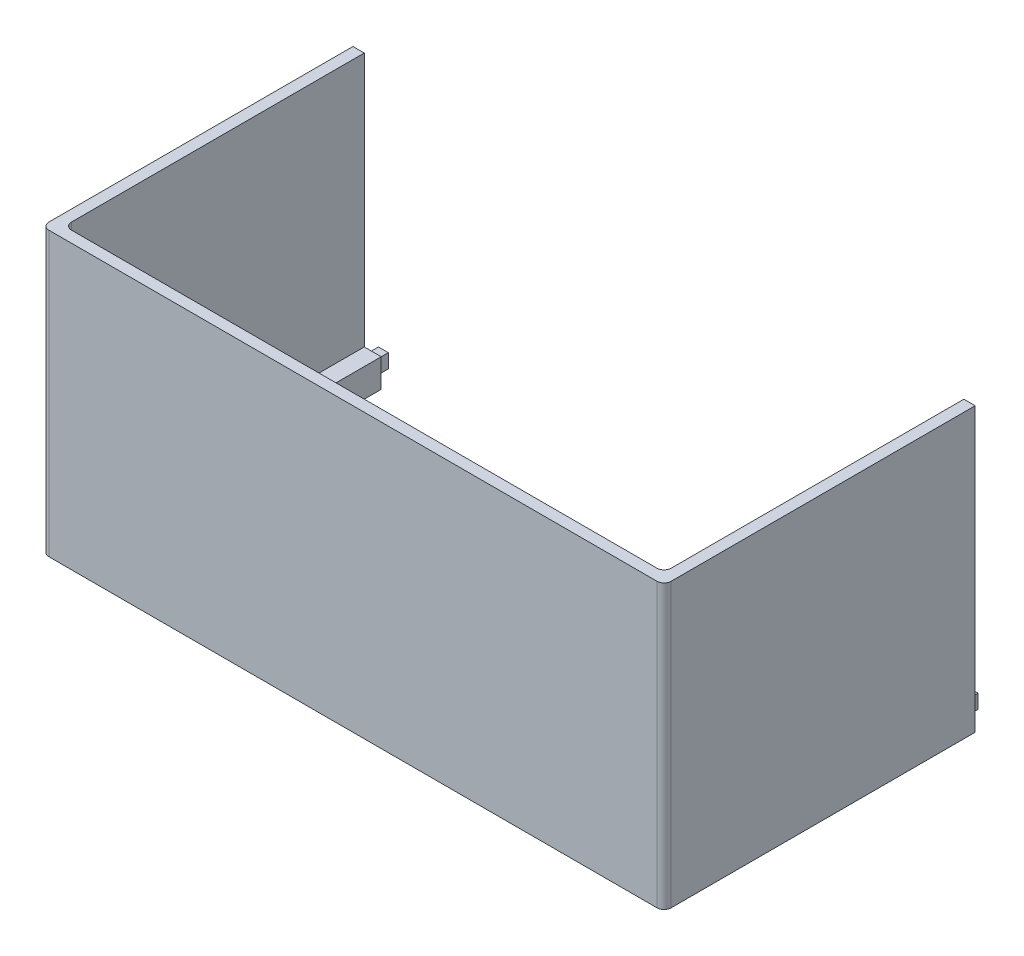
ISO-10303-21;
HEADER;
FILE_DESCRIPTION(('STEP AP214'),'2;1');
FILE_NAME('part.step','',(''),(''),'','','');
FILE_SCHEMA(('AUTOMOTIVE_DESIGN { 1 0 10303 214 1 1 1 1 }'));
ENDSEC;
DATA;
#1=APPLICATION_CONTEXT('core data for automotive mechanical design processes');
#2=APPLICATION_PROTOCOL_DEFINITION('international standard','automotive_design',2000,#1);
#3=PRODUCT_CONTEXT('',#1,'mechanical');
#4=PRODUCT('Part','Part','',(#3));
#5=PRODUCT_RELATED_PRODUCT_CATEGORY('part','',(#4));
#6=PRODUCT_DEFINITION_FORMATION('','',#4);
#7=PRODUCT_DEFINITION_CONTEXT('part definition',#1,'design');
#8=PRODUCT_DEFINITION('design','',#6,#7);
#9=PRODUCT_DEFINITION_SHAPE('','',#8);
#10=(LENGTH_UNIT() NAMED_UNIT(*) SI_UNIT(.MILLI.,.METRE.));
#11=(NAMED_UNIT(*) PLANE_ANGLE_UNIT() SI_UNIT($,.RADIAN.));
#12=(NAMED_UNIT(*) SI_UNIT($,.STERADIAN.) SOLID_ANGLE_UNIT());
#13=UNCERTAINTY_MEASURE_WITH_UNIT(LENGTH_MEASURE(1.E-05),#10,'distance_accuracy_value','');
#14=(GEOMETRIC_REPRESENTATION_CONTEXT(3) GLOBAL_UNCERTAINTY_ASSIGNED_CONTEXT((#13)) GLOBAL_UNIT_ASSIGNED_CONTEXT((#10,
#11,#12)) REPRESENTATION_CONTEXT('',''));
#15=CARTESIAN_POINT('',(0.,0.,0.));
#16=DIRECTION('',(0.,0.,1.));
#17=DIRECTION('',(1.,0.,0.));
#18=AXIS2_PLACEMENT_3D('',#15,#16,#17);
#19=CARTESIAN_POINT('',(-69.85,0.,7.25423999999999));
#20=DIRECTION('',(0.,0.,1.));
#21=DIRECTION('',(1.,0.,0.));
#22=AXIS2_PLACEMENT_3D('',#19,#20,#21);
#23=PLANE('',#22);
#24=DIRECTION('',(1.,0.,0.));
#25=VECTOR('',#24,1.);
#26=CARTESIAN_POINT('',(-69.85,0.,7.25423999999999));
#27=LINE('',#26,#25);
#28=CARTESIAN_POINT('',(-69.85,0.,7.25423999999999));
#29=VERTEX_POINT('',#28);
#30=CARTESIAN_POINT('',(-63.5000000000001,0.,7.25423999999999));
#31=VERTEX_POINT('',#30);
#32=EDGE_CURVE('E260',#29,#31,#27,.T.);
#33=ORIENTED_EDGE('',*,*,#32,.F.);
#34=DIRECTION('',(0.,1.,0.));
#35=VECTOR('',#34,1.);
#36=CARTESIAN_POINT('',(-69.85,0.,7.25423999999999));
#37=LINE('',#36,#35);
#38=CARTESIAN_POINT('',(-69.85,63.5,7.25423999999999));
#39=VERTEX_POINT('',#38);
#40=EDGE_CURVE('E263',#29,#39,#37,.T.);
#41=ORIENTED_EDGE('',*,*,#40,.T.);
#42=DIRECTION('',(1.,0.,0.));
#43=VECTOR('',#42,1.);
#44=CARTESIAN_POINT('',(-69.85,63.5,7.25423999999999));
#45=LINE('',#44,#43);
#46=CARTESIAN_POINT('',(-67.31,63.5,7.25423999999999));
#47=VERTEX_POINT('',#46);
#48=EDGE_CURVE('E265',#39,#47,#45,.T.);
#49=ORIENTED_EDGE('',*,*,#48,.T.);
#50=DIRECTION('',(0.,-1.,0.));
#51=VECTOR('',#50,1.);
#52=CARTESIAN_POINT('',(-67.31,63.5,7.25423999999999));
#53=LINE('',#52,#51);
#54=CARTESIAN_POINT('',(-67.31,6.35,7.25423999999999));
#55=VERTEX_POINT('',#54);
#56=EDGE_CURVE('E335',#47,#55,#53,.T.);
#57=ORIENTED_EDGE('',*,*,#56,.T.);
#58=DIRECTION('',(-1.,0.,0.));
#59=VECTOR('',#58,1.);
#60=CARTESIAN_POINT('',(0.,6.35,7.25423999999999));
#61=LINE('',#60,#59);
#62=CARTESIAN_POINT('',(-63.5000000000001,6.35,7.25423999999999));
#63=VERTEX_POINT('',#62);
#64=EDGE_CURVE('E270',#63,#55,#61,.T.);
#65=ORIENTED_EDGE('',*,*,#64,.F.);
#66=DIRECTION('',(0.,1.,0.));
#67=VECTOR('',#66,1.);
#68=CARTESIAN_POINT('',(-63.5000000000001,0.,7.25423999999999));
#69=LINE('',#68,#67);
#70=EDGE_CURVE('E274',#31,#63,#69,.T.);
#71=ORIENTED_EDGE('',*,*,#70,.F.);
#72=EDGE_LOOP('',(#33,#41,#49,#57,#65,#71));
#73=FACE_BOUND('',#72,.T.);
#74=DIRECTION('',(1.,0.,0.));
#75=VECTOR('',#74,1.);
#76=CARTESIAN_POINT('',(-67.31,4.7625,7.25423999999999));
#77=LINE('',#76,#75);
#78=CARTESIAN_POINT('',(-67.31,4.7625,7.25423999999999));
#79=VERTEX_POINT('',#78);
#80=CARTESIAN_POINT('',(-65.0875,4.7625,7.25423999999999));
#81=VERTEX_POINT('',#80);
#82=EDGE_CURVE('E220',#79,#81,#77,.T.);
#83=ORIENTED_EDGE('',*,*,#82,.F.);
#84=DIRECTION('',(0.,1.,0.));
#85=VECTOR('',#84,1.);
#86=CARTESIAN_POINT('',(-67.31,4.7625,7.25423999999999));
#87=LINE('',#86,#85);
#88=CARTESIAN_POINT('',(-67.31,1.5875,7.25423999999999));
#89=VERTEX_POINT('',#88);
#90=EDGE_CURVE('E217',#89,#79,#87,.T.);
#91=ORIENTED_EDGE('',*,*,#90,.F.);
#92=DIRECTION('',(-1.,0.,0.));
#93=VECTOR('',#92,1.);
#94=CARTESIAN_POINT('',(-67.31,1.5875,7.25423999999999));
#95=LINE('',#94,#93);
#96=CARTESIAN_POINT('',(-65.0875,1.5875,7.25423999999999));
#97=VERTEX_POINT('',#96);
#98=EDGE_CURVE('E690',#97,#89,#95,.T.);
#99=ORIENTED_EDGE('',*,*,#98,.F.);
#100=DIRECTION('',(0.,-1.,0.));
#101=VECTOR('',#100,1.);
#102=CARTESIAN_POINT('',(-65.0875,4.7625,7.25423999999999));
#103=LINE('',#102,#101);
#104=EDGE_CURVE('E692',#81,#97,#103,.T.);
#105=ORIENTED_EDGE('',*,*,#104,.F.);
#106=EDGE_LOOP('',(#83,#91,#99,#105));
#107=FACE_BOUND('',#106,.T.);
#108=ADVANCED_FACE('F34',(#73,#107),#23,.F.);
#109=CARTESIAN_POINT('',(67.31,6.35,7.25423999999999));
#110=VERTEX_POINT('',#109);
#111=CARTESIAN_POINT('',(63.5,6.35,7.25423999999999));
#112=VERTEX_POINT('',#111);
#113=EDGE_CURVE('E275',#110,#112,#61,.T.);
#114=ORIENTED_EDGE('',*,*,#113,.F.);
#115=DIRECTION('',(0.,1.,0.));
#116=VECTOR('',#115,1.);
#117=CARTESIAN_POINT('',(67.31,63.5,7.25423999999999));
#118=LINE('',#117,#116);
#119=CARTESIAN_POINT('',(67.31,63.5,7.25423999999999));
#120=VERTEX_POINT('',#119);
#121=EDGE_CURVE('E278',#110,#120,#118,.T.);
#122=ORIENTED_EDGE('',*,*,#121,.T.);
#123=CARTESIAN_POINT('',(69.85,63.5,7.25423999999999));
#124=VERTEX_POINT('',#123);
#125=EDGE_CURVE('E259',#120,#124,#45,.T.);
#126=ORIENTED_EDGE('',*,*,#125,.T.);
#127=DIRECTION('',(0.,1.,0.));
#128=VECTOR('',#127,1.);
#129=CARTESIAN_POINT('',(69.85,0.,7.25423999999999));
#130=LINE('',#129,#128);
#131=CARTESIAN_POINT('',(69.85,0.,7.25423999999999));
#132=VERTEX_POINT('',#131);
#133=EDGE_CURVE('E267',#132,#124,#130,.T.);
#134=ORIENTED_EDGE('',*,*,#133,.F.);
#135=CARTESIAN_POINT('',(63.5,0.,7.25423999999999));
#136=VERTEX_POINT('',#135);
#137=EDGE_CURVE('E264',#136,#132,#27,.T.);
#138=ORIENTED_EDGE('',*,*,#137,.F.);
#139=DIRECTION('',(0.,-1.,0.));
#140=VECTOR('',#139,1.);
#141=CARTESIAN_POINT('',(63.5,0.,7.25423999999999));
#142=LINE('',#141,#140);
#143=EDGE_CURVE('E281',#112,#136,#142,.T.);
#144=ORIENTED_EDGE('',*,*,#143,.F.);
#145=EDGE_LOOP('',(#114,#122,#126,#134,#138,#144));
#146=FACE_BOUND('',#145,.T.);
#147=DIRECTION('',(0.,-1.,0.));
#148=VECTOR('',#147,1.);
#149=CARTESIAN_POINT('',(67.31,4.7625,7.25423999999999));
#150=LINE('',#149,#148);
#151=CARTESIAN_POINT('',(67.31,4.7625,7.25423999999999));
#152=VERTEX_POINT('',#151);
#153=CARTESIAN_POINT('',(67.31,1.5875,7.25423999999999));
#154=VERTEX_POINT('',#153);
#155=EDGE_CURVE('E221',#152,#154,#150,.T.);
#156=ORIENTED_EDGE('',*,*,#155,.F.);
#157=DIRECTION('',(1.,0.,0.));
#158=VECTOR('',#157,1.);
#159=CARTESIAN_POINT('',(67.31,4.7625,7.25423999999999));
#160=LINE('',#159,#158);
#161=CARTESIAN_POINT('',(65.0875,4.7625,7.25423999999999));
#162=VERTEX_POINT('',#161);
#163=EDGE_CURVE('E234',#162,#152,#160,.T.);
#164=ORIENTED_EDGE('',*,*,#163,.F.);
#165=DIRECTION('',(0.,1.,0.));
#166=VECTOR('',#165,1.);
#167=CARTESIAN_POINT('',(65.0875,4.7625,7.25423999999999));
#168=LINE('',#167,#166);
#169=CARTESIAN_POINT('',(65.0875,1.5875,7.25423999999999));
#170=VERTEX_POINT('',#169);
#171=EDGE_CURVE('E243',#170,#162,#168,.T.);
#172=ORIENTED_EDGE('',*,*,#171,.F.);
#173=DIRECTION('',(-1.,0.,0.));
#174=VECTOR('',#173,1.);
#175=CARTESIAN_POINT('',(67.31,1.5875,7.25423999999999));
#176=LINE('',#175,#174);
#177=EDGE_CURVE('E224',#154,#170,#176,.T.);
#178=ORIENTED_EDGE('',*,*,#177,.F.);
#179=EDGE_LOOP('',(#156,#164,#172,#178));
#180=FACE_BOUND('',#179,.T.);
#181=ADVANCED_FACE('F394',(#146,#180),#23,.F.);
#182=CARTESIAN_POINT('',(69.85,6.35,77.10424));
#183=DIRECTION('',(-1.,0.,0.));
#184=DIRECTION('',(0.,0.,1.));
#185=AXIS2_PLACEMENT_3D('',#182,#183,#184);
#186=PLANE('',#185);
#187=DIRECTION('',(0.,0.,-1.));
#188=VECTOR('',#187,1.);
#189=CARTESIAN_POINT('',(69.85,63.5,-77.10424));
#190=LINE('',#189,#188);
#191=CARTESIAN_POINT('',(69.85,63.5,75.51674));
#192=VERTEX_POINT('',#191);
#193=EDGE_CURVE('E294',#192,#124,#190,.T.);
#194=ORIENTED_EDGE('',*,*,#193,.F.);
#195=DIRECTION('',(0.,-1.,0.));
#196=VECTOR('',#195,1.);
#197=CARTESIAN_POINT('',(69.85,6.35,75.51674));
#198=LINE('',#197,#196);
#199=CARTESIAN_POINT('',(69.85,0.,75.51674));
#200=VERTEX_POINT('',#199);
#201=EDGE_CURVE('E363',#192,#200,#198,.T.);
#202=ORIENTED_EDGE('',*,*,#201,.T.);
#203=DIRECTION('',(0.,0.,-1.));
#204=VECTOR('',#203,1.);
#205=CARTESIAN_POINT('',(69.85,0.,77.10424));
#206=LINE('',#205,#204);
#207=EDGE_CURVE('E325',#200,#132,#206,.T.);
#208=ORIENTED_EDGE('',*,*,#207,.T.);
#209=ORIENTED_EDGE('',*,*,#133,.T.);
#210=EDGE_LOOP('',(#194,#202,#208,#209));
#211=FACE_BOUND('',#210,.T.);
#212=ADVANCED_FACE('F434',(#211),#186,.F.);
#213=CARTESIAN_POINT('',(-69.85,6.35,77.10424));
#214=DIRECTION('',(1.,0.,0.));
#215=DIRECTION('',(0.,0.,-1.));
#216=AXIS2_PLACEMENT_3D('',#213,#214,#215);
#217=PLANE('',#216);
#218=DIRECTION('',(0.,0.,1.));
#219=VECTOR('',#218,1.);
#220=CARTESIAN_POINT('',(-69.85,0.,77.10424));
#221=LINE('',#220,#219);
#222=CARTESIAN_POINT('',(-69.85,0.,75.51674));
#223=VERTEX_POINT('',#222);
#224=EDGE_CURVE('E329',#29,#223,#221,.T.);
#225=ORIENTED_EDGE('',*,*,#224,.T.);
#226=DIRECTION('',(0.,-1.,0.));
#227=VECTOR('',#226,1.);
#228=CARTESIAN_POINT('',(-69.85,6.35,75.51674));
#229=LINE('',#228,#227);
#230=CARTESIAN_POINT('',(-69.85,63.5,75.51674));
#231=VERTEX_POINT('',#230);
#232=EDGE_CURVE('E346',#223,#231,#229,.F.);
#233=ORIENTED_EDGE('',*,*,#232,.T.);
#234=DIRECTION('',(0.,0.,1.));
#235=VECTOR('',#234,1.);
#236=CARTESIAN_POINT('',(-69.85,63.5,-77.10424));
#237=LINE('',#236,#235);
#238=EDGE_CURVE('E300',#39,#231,#237,.T.);
#239=ORIENTED_EDGE('',*,*,#238,.F.);
#240=ORIENTED_EDGE('',*,*,#40,.F.);
#241=EDGE_LOOP('',(#225,#233,#239,#240));
#242=FACE_BOUND('',#241,.T.);
#243=ADVANCED_FACE('F419',(#242),#217,.F.);
#244=CARTESIAN_POINT('',(-69.85,6.35,77.10424));
#245=DIRECTION('',(0.,0.,-1.));
#246=DIRECTION('',(-1.,0.,0.));
#247=AXIS2_PLACEMENT_3D('',#244,#245,#246);
#248=PLANE('',#247);
#249=DIRECTION('',(1.,0.,0.));
#250=VECTOR('',#249,1.);
#251=CARTESIAN_POINT('',(-69.85,63.5,77.10424));
#252=LINE('',#251,#250);
#253=CARTESIAN_POINT('',(-68.2624999999999,63.5,77.10424));
#254=VERTEX_POINT('',#253);
#255=CARTESIAN_POINT('',(68.2625,63.5,77.10424));
#256=VERTEX_POINT('',#255);
#257=EDGE_CURVE('E303',#254,#256,#252,.T.);
#258=ORIENTED_EDGE('',*,*,#257,.F.);
#259=DIRECTION('',(0.,-1.,0.));
#260=VECTOR('',#259,1.);
#261=CARTESIAN_POINT('',(-68.2624999999999,6.35,77.10424));
#262=LINE('',#261,#260);
#263=CARTESIAN_POINT('',(-68.2624999999999,0.,77.10424));
#264=VERTEX_POINT('',#263);
#265=EDGE_CURVE('E339',#254,#264,#262,.T.);
#266=ORIENTED_EDGE('',*,*,#265,.T.);
#267=DIRECTION('',(1.,0.,0.));
#268=VECTOR('',#267,1.);
#269=CARTESIAN_POINT('',(-69.85,0.,77.10424));
#270=LINE('',#269,#268);
#271=CARTESIAN_POINT('',(68.2625,0.,77.10424));
#272=VERTEX_POINT('',#271);
#273=EDGE_CURVE('E332',#264,#272,#270,.T.);
#274=ORIENTED_EDGE('',*,*,#273,.T.);
#275=DIRECTION('',(0.,-1.,0.));
#276=VECTOR('',#275,1.);
#277=CARTESIAN_POINT('',(68.2625,6.35,77.10424));
#278=LINE('',#277,#276);
#279=EDGE_CURVE('E337',#272,#256,#278,.F.);
#280=ORIENTED_EDGE('',*,*,#279,.T.);
#281=EDGE_LOOP('',(#258,#266,#274,#280));
#282=FACE_BOUND('',#281,.T.);
#283=ADVANCED_FACE('F428',(#282),#248,.F.);
#284=CARTESIAN_POINT('',(0.,6.35,0.));
#285=DIRECTION('',(0.,-1.,0.));
#286=DIRECTION('',(0.,0.,-1.));
#287=AXIS2_PLACEMENT_3D('',#284,#285,#286);
#288=PLANE('',#287);
#289=DIRECTION('',(0.,0.,1.));
#290=VECTOR('',#289,1.);
#291=CARTESIAN_POINT('',(-67.31,6.35,-74.56424));
#292=LINE('',#291,#290);
#293=CARTESIAN_POINT('',(-67.31,6.35,72.97674));
#294=VERTEX_POINT('',#293);
#295=EDGE_CURVE('E296',#55,#294,#292,.T.);
#296=ORIENTED_EDGE('',*,*,#295,.T.);
#297=CARTESIAN_POINT('',(-65.7225,6.35,72.97674));
#298=DIRECTION('',(0.,-1.,0.));
#299=DIRECTION('',(0.,0.,-1.));
#300=AXIS2_PLACEMENT_3D('',#297,#298,#299);
#301=CIRCLE('',#300,1.5875);
#302=CARTESIAN_POINT('',(-65.7225,6.35,74.56424));
#303=VERTEX_POINT('',#302);
#304=EDGE_CURVE('E57',#294,#303,#301,.F.);
#305=ORIENTED_EDGE('',*,*,#304,.T.);
#306=DIRECTION('',(1.,0.,0.));
#307=VECTOR('',#306,1.);
#308=CARTESIAN_POINT('',(-67.31,6.35,74.56424));
#309=LINE('',#308,#307);
#310=CARTESIAN_POINT('',(65.7225,6.35,74.56424));
#311=VERTEX_POINT('',#310);
#312=EDGE_CURVE('E288',#303,#311,#309,.T.);
#313=ORIENTED_EDGE('',*,*,#312,.T.);
#314=CARTESIAN_POINT('',(65.7225,6.35,72.97674));
#315=DIRECTION('',(0.,-1.,0.));
#316=DIRECTION('',(0.,0.,-1.));
#317=AXIS2_PLACEMENT_3D('',#314,#315,#316);
#318=CIRCLE('',#317,1.5875);
#319=CARTESIAN_POINT('',(67.31,6.35,72.97674));
#320=VERTEX_POINT('',#319);
#321=EDGE_CURVE('E49',#311,#320,#318,.F.);
#322=ORIENTED_EDGE('',*,*,#321,.T.);
#323=DIRECTION('',(0.,0.,-1.));
#324=VECTOR('',#323,1.);
#325=CARTESIAN_POINT('',(67.31,6.35,-74.56424));
#326=LINE('',#325,#324);
#327=EDGE_CURVE('E284',#320,#110,#326,.T.);
#328=ORIENTED_EDGE('',*,*,#327,.T.);
#329=ORIENTED_EDGE('',*,*,#113,.T.);
#330=DIRECTION('',(0.,0.,-1.));
#331=VECTOR('',#330,1.);
#332=CARTESIAN_POINT('',(63.5,6.35,70.75424));
#333=LINE('',#332,#331);
#334=CARTESIAN_POINT('',(63.5,6.35,70.75424));
#335=VERTEX_POINT('',#334);
#336=EDGE_CURVE('E306',#335,#112,#333,.T.);
#337=ORIENTED_EDGE('',*,*,#336,.F.);
#338=DIRECTION('',(1.,0.,0.));
#339=VECTOR('',#338,1.);
#340=CARTESIAN_POINT('',(-63.5000000000001,6.35,70.75424));
#341=LINE('',#340,#339);
#342=CARTESIAN_POINT('',(-63.5000000000001,6.35,70.75424));
#343=VERTEX_POINT('',#342);
#344=EDGE_CURVE('E311',#343,#335,#341,.T.);
#345=ORIENTED_EDGE('',*,*,#344,.F.);
#346=DIRECTION('',(0.,0.,1.));
#347=VECTOR('',#346,1.);
#348=CARTESIAN_POINT('',(-63.5000000000001,6.35,70.75424));
#349=LINE('',#348,#347);
#350=EDGE_CURVE('E319',#63,#343,#349,.T.);
#351=ORIENTED_EDGE('',*,*,#350,.F.);
#352=ORIENTED_EDGE('',*,*,#64,.T.);
#353=EDGE_LOOP('',(#296,#305,#313,#322,#328,#329,#337,#345,#351,#352));
#354=FACE_BOUND('',#353,.T.);
#355=ADVANCED_FACE('F381',(#354),#288,.F.);
#356=CARTESIAN_POINT('',(0.,0.,0.));
#357=DIRECTION('',(0.,-1.,0.));
#358=DIRECTION('',(0.,0.,-1.));
#359=AXIS2_PLACEMENT_3D('',#356,#357,#358);
#360=PLANE('',#359);
#361=ORIENTED_EDGE('',*,*,#273,.F.);
#362=CARTESIAN_POINT('',(-68.2624999999999,0.,75.51674));
#363=DIRECTION('',(0.,-1.,0.));
#364=DIRECTION('',(0.,0.,-1.));
#365=AXIS2_PLACEMENT_3D('',#362,#363,#364);
#366=CIRCLE('',#365,1.5875);
#367=EDGE_CURVE('E344',#264,#223,#366,.T.);
#368=ORIENTED_EDGE('',*,*,#367,.T.);
#369=ORIENTED_EDGE('',*,*,#224,.F.);
#370=ORIENTED_EDGE('',*,*,#32,.T.);
#371=DIRECTION('',(0.,0.,1.));
#372=VECTOR('',#371,1.);
#373=CARTESIAN_POINT('',(-63.5000000000001,0.,70.75424));
#374=LINE('',#373,#372);
#375=CARTESIAN_POINT('',(-63.5000000000001,0.,70.75424));
#376=VERTEX_POINT('',#375);
#377=EDGE_CURVE('E310',#31,#376,#374,.T.);
#378=ORIENTED_EDGE('',*,*,#377,.T.);
#379=DIRECTION('',(1.,0.,0.));
#380=VECTOR('',#379,1.);
#381=CARTESIAN_POINT('',(-63.5000000000001,0.,70.75424));
#382=LINE('',#381,#380);
#383=CARTESIAN_POINT('',(63.5,0.,70.75424));
#384=VERTEX_POINT('',#383);
#385=EDGE_CURVE('E313',#376,#384,#382,.T.);
#386=ORIENTED_EDGE('',*,*,#385,.T.);
#387=DIRECTION('',(0.,0.,-1.));
#388=VECTOR('',#387,1.);
#389=CARTESIAN_POINT('',(63.5,0.,70.75424));
#390=LINE('',#389,#388);
#391=EDGE_CURVE('E307',#384,#136,#390,.T.);
#392=ORIENTED_EDGE('',*,*,#391,.T.);
#393=ORIENTED_EDGE('',*,*,#137,.T.);
#394=ORIENTED_EDGE('',*,*,#207,.F.);
#395=CARTESIAN_POINT('',(68.2625,0.,75.51674));
#396=DIRECTION('',(0.,-1.,0.));
#397=DIRECTION('',(0.,0.,-1.));
#398=AXIS2_PLACEMENT_3D('',#395,#396,#397);
#399=CIRCLE('',#398,1.5875);
#400=EDGE_CURVE('E342',#200,#272,#399,.T.);
#401=ORIENTED_EDGE('',*,*,#400,.T.);
#402=EDGE_LOOP('',(#361,#368,#369,#370,#378,#386,#392,#393,#394,#401));
#403=FACE_BOUND('',#402,.T.);
#404=ADVANCED_FACE('F416',(#403),#360,.T.);
#405=CARTESIAN_POINT('',(63.5,0.,70.75424));
#406=DIRECTION('',(1.,0.,0.));
#407=DIRECTION('',(0.,0.,-1.));
#408=AXIS2_PLACEMENT_3D('',#405,#406,#407);
#409=PLANE('',#408);
#410=ORIENTED_EDGE('',*,*,#336,.T.);
#411=ORIENTED_EDGE('',*,*,#143,.T.);
#412=ORIENTED_EDGE('',*,*,#391,.F.);
#413=DIRECTION('',(0.,1.,0.));
#414=VECTOR('',#413,1.);
#415=CARTESIAN_POINT('',(63.5,0.,70.75424));
#416=LINE('',#415,#414);
#417=EDGE_CURVE('E323',#384,#335,#416,.T.);
#418=ORIENTED_EDGE('',*,*,#417,.T.);
#419=EDGE_LOOP('',(#410,#411,#412,#418));
#420=FACE_BOUND('',#419,.T.);
#421=ADVANCED_FACE('F400',(#420),#409,.F.);
#422=CARTESIAN_POINT('',(-63.5000000000001,0.,70.75424));
#423=DIRECTION('',(0.,0.,1.));
#424=DIRECTION('',(1.,0.,0.));
#425=AXIS2_PLACEMENT_3D('',#422,#423,#424);
#426=PLANE('',#425);
#427=ORIENTED_EDGE('',*,*,#344,.T.);
#428=ORIENTED_EDGE('',*,*,#417,.F.);
#429=ORIENTED_EDGE('',*,*,#385,.F.);
#430=DIRECTION('',(0.,1.,0.));
#431=VECTOR('',#430,1.);
#432=CARTESIAN_POINT('',(-63.5000000000001,0.,70.75424));
#433=LINE('',#432,#431);
#434=EDGE_CURVE('E316',#376,#343,#433,.T.);
#435=ORIENTED_EDGE('',*,*,#434,.T.);
#436=EDGE_LOOP('',(#427,#428,#429,#435));
#437=FACE_BOUND('',#436,.T.);
#438=ADVANCED_FACE('F404',(#437),#426,.F.);
#439=CARTESIAN_POINT('',(-63.5000000000001,0.,70.75424));
#440=DIRECTION('',(-1.,0.,0.));
#441=DIRECTION('',(0.,0.,1.));
#442=AXIS2_PLACEMENT_3D('',#439,#440,#441);
#443=PLANE('',#442);
#444=ORIENTED_EDGE('',*,*,#377,.F.);
#445=ORIENTED_EDGE('',*,*,#70,.T.);
#446=ORIENTED_EDGE('',*,*,#350,.T.);
#447=ORIENTED_EDGE('',*,*,#434,.F.);
#448=EDGE_LOOP('',(#444,#445,#446,#447));
#449=FACE_BOUND('',#448,.T.);
#450=ADVANCED_FACE('F409',(#449),#443,.F.);
#451=CARTESIAN_POINT('',(0.,63.5,0.));
#452=DIRECTION('',(0.,1.,0.));
#453=DIRECTION('',(0.,0.,1.));
#454=AXIS2_PLACEMENT_3D('',#451,#452,#453);
#455=PLANE('',#454);
#456=ORIENTED_EDGE('',*,*,#238,.T.);
#457=CARTESIAN_POINT('',(-68.2624999999999,63.5,75.51674));
#458=DIRECTION('',(0.,1.,0.));
#459=DIRECTION('',(0.,0.,1.));
#460=AXIS2_PLACEMENT_3D('',#457,#458,#459);
#461=CIRCLE('',#460,1.5875);
#462=EDGE_CURVE('E350',#231,#254,#461,.T.);
#463=ORIENTED_EDGE('',*,*,#462,.T.);
#464=ORIENTED_EDGE('',*,*,#257,.T.);
#465=CARTESIAN_POINT('',(68.2625,63.5,75.51674));
#466=DIRECTION('',(0.,1.,0.));
#467=DIRECTION('',(0.,0.,1.));
#468=AXIS2_PLACEMENT_3D('',#465,#466,#467);
#469=CIRCLE('',#468,1.5875);
#470=EDGE_CURVE('E348',#256,#192,#469,.T.);
#471=ORIENTED_EDGE('',*,*,#470,.T.);
#472=ORIENTED_EDGE('',*,*,#193,.T.);
#473=ORIENTED_EDGE('',*,*,#125,.F.);
#474=DIRECTION('',(0.,0.,-1.));
#475=VECTOR('',#474,1.);
#476=CARTESIAN_POINT('',(67.31,63.5,-74.56424));
#477=LINE('',#476,#475);
#478=CARTESIAN_POINT('',(67.31,63.5,72.97674));
#479=VERTEX_POINT('',#478);
#480=EDGE_CURVE('E285',#479,#120,#477,.T.);
#481=ORIENTED_EDGE('',*,*,#480,.F.);
#482=CARTESIAN_POINT('',(65.7225,63.5,72.97674));
#483=DIRECTION('',(0.,1.,0.));
#484=DIRECTION('',(0.,0.,1.));
#485=AXIS2_PLACEMENT_3D('',#482,#483,#484);
#486=CIRCLE('',#485,1.5875);
#487=CARTESIAN_POINT('',(65.7225,63.5,74.56424));
#488=VERTEX_POINT('',#487);
#489=EDGE_CURVE('E11',#479,#488,#486,.F.);
#490=ORIENTED_EDGE('',*,*,#489,.T.);
#491=DIRECTION('',(1.,0.,0.));
#492=VECTOR('',#491,1.);
#493=CARTESIAN_POINT('',(-67.31,63.5,74.56424));
#494=LINE('',#493,#492);
#495=CARTESIAN_POINT('',(-65.7225,63.5,74.56424));
#496=VERTEX_POINT('',#495);
#497=EDGE_CURVE('E291',#496,#488,#494,.T.);
#498=ORIENTED_EDGE('',*,*,#497,.F.);
#499=CARTESIAN_POINT('',(-65.7225,63.5,72.97674));
#500=DIRECTION('',(0.,1.,0.));
#501=DIRECTION('',(0.,0.,1.));
#502=AXIS2_PLACEMENT_3D('',#499,#500,#501);
#503=CIRCLE('',#502,1.5875);
#504=CARTESIAN_POINT('',(-67.31,63.5,72.97674));
#505=VERTEX_POINT('',#504);
#506=EDGE_CURVE('E42',#496,#505,#503,.F.);
#507=ORIENTED_EDGE('',*,*,#506,.T.);
#508=DIRECTION('',(0.,0.,1.));
#509=VECTOR('',#508,1.);
#510=CARTESIAN_POINT('',(-67.31,63.5,-74.56424));
#511=LINE('',#510,#509);
#512=EDGE_CURVE('E287',#47,#505,#511,.T.);
#513=ORIENTED_EDGE('',*,*,#512,.F.);
#514=ORIENTED_EDGE('',*,*,#48,.F.);
#515=EDGE_LOOP('',(#456,#463,#464,#471,#472,#473,#481,#490,#498,#507,#513,#514));
#516=FACE_BOUND('',#515,.T.);
#517=ADVANCED_FACE('F369',(#516),#455,.T.);
#518=CARTESIAN_POINT('',(67.31,63.5,-74.56424));
#519=DIRECTION('',(-1.,0.,0.));
#520=DIRECTION('',(0.,0.,1.));
#521=AXIS2_PLACEMENT_3D('',#518,#519,#520);
#522=PLANE('',#521);
#523=ORIENTED_EDGE('',*,*,#327,.F.);
#524=DIRECTION('',(0.,-1.,0.));
#525=VECTOR('',#524,1.);
#526=CARTESIAN_POINT('',(67.31,63.5,72.97674));
#527=LINE('',#526,#525);
#528=EDGE_CURVE('E361',#320,#479,#527,.F.);
#529=ORIENTED_EDGE('',*,*,#528,.T.);
#530=ORIENTED_EDGE('',*,*,#480,.T.);
#531=ORIENTED_EDGE('',*,*,#121,.F.);
#532=EDGE_LOOP('',(#523,#529,#530,#531));
#533=FACE_BOUND('',#532,.T.);
#534=ADVANCED_FACE('F387',(#533),#522,.T.);
#535=CARTESIAN_POINT('',(-67.31,63.5,-74.56424));
#536=DIRECTION('',(1.,0.,0.));
#537=DIRECTION('',(0.,0.,-1.));
#538=AXIS2_PLACEMENT_3D('',#535,#536,#537);
#539=PLANE('',#538);
#540=ORIENTED_EDGE('',*,*,#512,.T.);
#541=DIRECTION('',(0.,-1.,0.));
#542=VECTOR('',#541,1.);
#543=CARTESIAN_POINT('',(-67.31,6.35,72.97674));
#544=LINE('',#543,#542);
#545=EDGE_CURVE('E352',#505,#294,#544,.T.);
#546=ORIENTED_EDGE('',*,*,#545,.T.);
#547=ORIENTED_EDGE('',*,*,#295,.F.);
#548=ORIENTED_EDGE('',*,*,#56,.F.);
#549=EDGE_LOOP('',(#540,#546,#547,#548));
#550=FACE_BOUND('',#549,.T.);
#551=ADVANCED_FACE('F376',(#550),#539,.T.);
#552=CARTESIAN_POINT('',(-67.31,63.5,74.56424));
#553=DIRECTION('',(0.,0.,-1.));
#554=DIRECTION('',(-1.,0.,0.));
#555=AXIS2_PLACEMENT_3D('',#552,#553,#554);
#556=PLANE('',#555);
#557=ORIENTED_EDGE('',*,*,#312,.F.);
#558=DIRECTION('',(0.,-1.,0.));
#559=VECTOR('',#558,1.);
#560=CARTESIAN_POINT('',(-65.7225,63.5,74.56424));
#561=LINE('',#560,#559);
#562=EDGE_CURVE('E359',#303,#496,#561,.F.);
#563=ORIENTED_EDGE('',*,*,#562,.T.);
#564=ORIENTED_EDGE('',*,*,#497,.T.);
#565=DIRECTION('',(0.,-1.,0.));
#566=VECTOR('',#565,1.);
#567=CARTESIAN_POINT('',(65.7225,6.35,74.56424));
#568=LINE('',#567,#566);
#569=EDGE_CURVE('E357',#488,#311,#568,.T.);
#570=ORIENTED_EDGE('',*,*,#569,.T.);
#571=EDGE_LOOP('',(#557,#563,#564,#570));
#572=FACE_BOUND('',#571,.T.);
#573=ADVANCED_FACE('F380',(#572),#556,.T.);
#574=CARTESIAN_POINT('',(67.31,4.7625,4.07924));
#575=DIRECTION('',(-1.,0.,0.));
#576=DIRECTION('',(0.,0.,1.));
#577=AXIS2_PLACEMENT_3D('',#574,#575,#576);
#578=PLANE('',#577);
#579=ORIENTED_EDGE('',*,*,#155,.T.);
#580=DIRECTION('',(0.,0.,1.));
#581=VECTOR('',#580,1.);
#582=CARTESIAN_POINT('',(67.31,1.5875,4.07924));
#583=LINE('',#582,#581);
#584=CARTESIAN_POINT('',(67.31,1.5875,4.07924));
#585=VERTEX_POINT('',#584);
#586=EDGE_CURVE('E256',#585,#154,#583,.T.);
#587=ORIENTED_EDGE('',*,*,#586,.F.);
#588=DIRECTION('',(0.,-1.,0.));
#589=VECTOR('',#588,1.);
#590=CARTESIAN_POINT('',(67.31,4.7625,4.07924));
#591=LINE('',#590,#589);
#592=CARTESIAN_POINT('',(67.31,4.7625,4.07924));
#593=VERTEX_POINT('',#592);
#594=EDGE_CURVE('E230',#593,#585,#591,.T.);
#595=ORIENTED_EDGE('',*,*,#594,.F.);
#596=DIRECTION('',(0.,0.,1.));
#597=VECTOR('',#596,1.);
#598=CARTESIAN_POINT('',(67.31,4.7625,4.07924));
#599=LINE('',#598,#597);
#600=EDGE_CURVE('E239',#593,#152,#599,.T.);
#601=ORIENTED_EDGE('',*,*,#600,.T.);
#602=EDGE_LOOP('',(#579,#587,#595,#601));
#603=FACE_BOUND('',#602,.T.);
#604=ADVANCED_FACE('F452',(#603),#578,.F.);
#605=CARTESIAN_POINT('',(67.31,1.5875,4.07924));
#606=DIRECTION('',(0.,1.,0.));
#607=DIRECTION('',(0.,0.,1.));
#608=AXIS2_PLACEMENT_3D('',#605,#606,#607);
#609=PLANE('',#608);
#610=ORIENTED_EDGE('',*,*,#177,.T.);
#611=DIRECTION('',(0.,0.,1.));
#612=VECTOR('',#611,1.);
#613=CARTESIAN_POINT('',(65.0875,1.5875,4.07924));
#614=LINE('',#613,#612);
#615=CARTESIAN_POINT('',(65.0875,1.5875,4.07924));
#616=VERTEX_POINT('',#615);
#617=EDGE_CURVE('E253',#616,#170,#614,.T.);
#618=ORIENTED_EDGE('',*,*,#617,.F.);
#619=DIRECTION('',(-1.,0.,0.));
#620=VECTOR('',#619,1.);
#621=CARTESIAN_POINT('',(67.31,1.5875,4.07924));
#622=LINE('',#621,#620);
#623=EDGE_CURVE('E233',#585,#616,#622,.T.);
#624=ORIENTED_EDGE('',*,*,#623,.F.);
#625=ORIENTED_EDGE('',*,*,#586,.T.);
#626=EDGE_LOOP('',(#610,#618,#624,#625));
#627=FACE_BOUND('',#626,.T.);
#628=ADVANCED_FACE('F587',(#627),#609,.F.);
#629=CARTESIAN_POINT('',(65.0875,4.7625,4.07924));
#630=DIRECTION('',(1.,0.,0.));
#631=DIRECTION('',(0.,0.,-1.));
#632=AXIS2_PLACEMENT_3D('',#629,#630,#631);
#633=PLANE('',#632);
#634=ORIENTED_EDGE('',*,*,#171,.T.);
#635=DIRECTION('',(0.,0.,1.));
#636=VECTOR('',#635,1.);
#637=CARTESIAN_POINT('',(65.0875,4.7625,4.07924));
#638=LINE('',#637,#636);
#639=CARTESIAN_POINT('',(65.0875,4.7625,4.07924));
#640=VERTEX_POINT('',#639);
#641=EDGE_CURVE('E250',#640,#162,#638,.T.);
#642=ORIENTED_EDGE('',*,*,#641,.F.);
#643=DIRECTION('',(0.,1.,0.));
#644=VECTOR('',#643,1.);
#645=CARTESIAN_POINT('',(65.0875,4.7625,4.07924));
#646=LINE('',#645,#644);
#647=EDGE_CURVE('E236',#616,#640,#646,.T.);
#648=ORIENTED_EDGE('',*,*,#647,.F.);
#649=ORIENTED_EDGE('',*,*,#617,.T.);
#650=EDGE_LOOP('',(#634,#642,#648,#649));
#651=FACE_BOUND('',#650,.T.);
#652=ADVANCED_FACE('F579',(#651),#633,.F.);
#653=CARTESIAN_POINT('',(67.31,4.7625,4.07924));
#654=DIRECTION('',(0.,-1.,0.));
#655=DIRECTION('',(0.,0.,-1.));
#656=AXIS2_PLACEMENT_3D('',#653,#654,#655);
#657=PLANE('',#656);
#658=ORIENTED_EDGE('',*,*,#163,.T.);
#659=ORIENTED_EDGE('',*,*,#600,.F.);
#660=DIRECTION('',(1.,0.,0.));
#661=VECTOR('',#660,1.);
#662=CARTESIAN_POINT('',(67.31,4.7625,4.07924));
#663=LINE('',#662,#661);
#664=EDGE_CURVE('E238',#640,#593,#663,.T.);
#665=ORIENTED_EDGE('',*,*,#664,.F.);
#666=ORIENTED_EDGE('',*,*,#641,.T.);
#667=EDGE_LOOP('',(#658,#659,#665,#666));
#668=FACE_BOUND('',#667,.T.);
#669=ADVANCED_FACE('F571',(#668),#657,.F.);
#670=CARTESIAN_POINT('',(0.,0.,4.07924));
#671=DIRECTION('',(0.,0.,-1.));
#672=DIRECTION('',(-1.,0.,0.));
#673=AXIS2_PLACEMENT_3D('',#670,#671,#672);
#674=PLANE('',#673);
#675=ORIENTED_EDGE('',*,*,#594,.T.);
#676=ORIENTED_EDGE('',*,*,#623,.T.);
#677=ORIENTED_EDGE('',*,*,#647,.T.);
#678=ORIENTED_EDGE('',*,*,#664,.T.);
#679=EDGE_LOOP('',(#675,#676,#677,#678));
#680=FACE_BOUND('',#679,.T.);
#681=ADVANCED_FACE('F564',(#680),#674,.T.);
#682=CARTESIAN_POINT('',(-67.31,4.7625,4.07924));
#683=DIRECTION('',(0.,-1.,0.));
#684=DIRECTION('',(0.,0.,-1.));
#685=AXIS2_PLACEMENT_3D('',#682,#683,#684);
#686=PLANE('',#685);
#687=ORIENTED_EDGE('',*,*,#82,.T.);
#688=DIRECTION('',(0.,0.,1.));
#689=VECTOR('',#688,1.);
#690=CARTESIAN_POINT('',(-65.0875,4.7625,4.07924));
#691=LINE('',#690,#689);
#692=CARTESIAN_POINT('',(-65.0875,4.7625,4.07924));
#693=VERTEX_POINT('',#692);
#694=EDGE_CURVE('E201',#693,#81,#691,.T.);
#695=ORIENTED_EDGE('',*,*,#694,.F.);
#696=DIRECTION('',(1.,0.,0.));
#697=VECTOR('',#696,1.);
#698=CARTESIAN_POINT('',(-67.31,4.7625,4.07924));
#699=LINE('',#698,#697);
#700=CARTESIAN_POINT('',(-67.31,4.7625,4.07924));
#701=VERTEX_POINT('',#700);
#702=EDGE_CURVE('E208',#701,#693,#699,.T.);
#703=ORIENTED_EDGE('',*,*,#702,.F.);
#704=DIRECTION('',(0.,0.,1.));
#705=VECTOR('',#704,1.);
#706=CARTESIAN_POINT('',(-67.31,4.7625,4.07924));
#707=LINE('',#706,#705);
#708=EDGE_CURVE('E695',#701,#79,#707,.T.);
#709=ORIENTED_EDGE('',*,*,#708,.T.);
#710=EDGE_LOOP('',(#687,#695,#703,#709));
#711=FACE_BOUND('',#710,.T.);
#712=ADVANCED_FACE('F219',(#711),#686,.F.);
#713=CARTESIAN_POINT('',(-65.0875,4.7625,4.07924));
#714=DIRECTION('',(-1.,0.,0.));
#715=DIRECTION('',(0.,0.,1.));
#716=AXIS2_PLACEMENT_3D('',#713,#714,#715);
#717=PLANE('',#716);
#718=ORIENTED_EDGE('',*,*,#104,.T.);
#719=DIRECTION('',(0.,0.,1.));
#720=VECTOR('',#719,1.);
#721=CARTESIAN_POINT('',(-65.0875,1.5875,4.07924));
#722=LINE('',#721,#720);
#723=CARTESIAN_POINT('',(-65.0875,1.5875,4.07924));
#724=VERTEX_POINT('',#723);
#725=EDGE_CURVE('E204',#724,#97,#722,.T.);
#726=ORIENTED_EDGE('',*,*,#725,.F.);
#727=DIRECTION('',(0.,-1.,0.));
#728=VECTOR('',#727,1.);
#729=CARTESIAN_POINT('',(-65.0875,4.7625,4.07924));
#730=LINE('',#729,#728);
#731=EDGE_CURVE('E196',#693,#724,#730,.T.);
#732=ORIENTED_EDGE('',*,*,#731,.F.);
#733=ORIENTED_EDGE('',*,*,#694,.T.);
#734=EDGE_LOOP('',(#718,#726,#732,#733));
#735=FACE_BOUND('',#734,.T.);
#736=ADVANCED_FACE('F199',(#735),#717,.F.);
#737=CARTESIAN_POINT('',(-67.31,1.5875,4.07924));
#738=DIRECTION('',(0.,1.,0.));
#739=DIRECTION('',(0.,0.,1.));
#740=AXIS2_PLACEMENT_3D('',#737,#738,#739);
#741=PLANE('',#740);
#742=ORIENTED_EDGE('',*,*,#98,.T.);
#743=DIRECTION('',(0.,0.,1.));
#744=VECTOR('',#743,1.);
#745=CARTESIAN_POINT('',(-67.31,1.5875,4.07924));
#746=LINE('',#745,#744);
#747=CARTESIAN_POINT('',(-67.31,1.5875,4.07924));
#748=VERTEX_POINT('',#747);
#749=EDGE_CURVE('E226',#748,#89,#746,.T.);
#750=ORIENTED_EDGE('',*,*,#749,.F.);
#751=DIRECTION('',(-1.,0.,0.));
#752=VECTOR('',#751,1.);
#753=CARTESIAN_POINT('',(-67.31,1.5875,4.07924));
#754=LINE('',#753,#752);
#755=EDGE_CURVE('E207',#724,#748,#754,.T.);
#756=ORIENTED_EDGE('',*,*,#755,.F.);
#757=ORIENTED_EDGE('',*,*,#725,.T.);
#758=EDGE_LOOP('',(#742,#750,#756,#757));
#759=FACE_BOUND('',#758,.T.);
#760=ADVANCED_FACE('F543',(#759),#741,.F.);
#761=CARTESIAN_POINT('',(-67.31,4.7625,4.07924));
#762=DIRECTION('',(1.,0.,0.));
#763=DIRECTION('',(0.,0.,-1.));
#764=AXIS2_PLACEMENT_3D('',#761,#762,#763);
#765=PLANE('',#764);
#766=ORIENTED_EDGE('',*,*,#90,.T.);
#767=ORIENTED_EDGE('',*,*,#708,.F.);
#768=DIRECTION('',(0.,1.,0.));
#769=VECTOR('',#768,1.);
#770=CARTESIAN_POINT('',(-67.31,4.7625,4.07924));
#771=LINE('',#770,#769);
#772=EDGE_CURVE('E213',#748,#701,#771,.T.);
#773=ORIENTED_EDGE('',*,*,#772,.F.);
#774=ORIENTED_EDGE('',*,*,#749,.T.);
#775=EDGE_LOOP('',(#766,#767,#773,#774));
#776=FACE_BOUND('',#775,.T.);
#777=ADVANCED_FACE('F537',(#776),#765,.F.);
#778=CARTESIAN_POINT('',(0.,0.,4.07924));
#779=DIRECTION('',(0.,0.,-1.));
#780=DIRECTION('',(-1.,0.,0.));
#781=AXIS2_PLACEMENT_3D('',#778,#779,#780);
#782=PLANE('',#781);
#783=ORIENTED_EDGE('',*,*,#702,.T.);
#784=ORIENTED_EDGE('',*,*,#731,.T.);
#785=ORIENTED_EDGE('',*,*,#755,.T.);
#786=ORIENTED_EDGE('',*,*,#772,.T.);
#787=EDGE_LOOP('',(#783,#784,#785,#786));
#788=FACE_BOUND('',#787,.T.);
#789=ADVANCED_FACE('F211',(#788),#782,.T.);
#790=CARTESIAN_POINT('',(-68.2624999999999,6.35,75.51674));
#791=DIRECTION('',(0.,-1.,0.));
#792=DIRECTION('',(0.,0.,-1.));
#793=AXIS2_PLACEMENT_3D('',#790,#791,#792);
#794=CYLINDRICAL_SURFACE('',#793,1.5875);
#795=ORIENTED_EDGE('',*,*,#462,.F.);
#796=ORIENTED_EDGE('',*,*,#232,.F.);
#797=ORIENTED_EDGE('',*,*,#367,.F.);
#798=ORIENTED_EDGE('',*,*,#265,.F.);
#799=EDGE_LOOP('',(#795,#796,#797,#798));
#800=FACE_BOUND('',#799,.T.);
#801=ADVANCED_FACE('F423',(#800),#794,.T.);
#802=CARTESIAN_POINT('',(-65.7225,63.5,72.97674));
#803=DIRECTION('',(0.,1.,0.));
#804=DIRECTION('',(0.,0.,1.));
#805=AXIS2_PLACEMENT_3D('',#802,#803,#804);
#806=CYLINDRICAL_SURFACE('',#805,1.5875);
#807=ORIENTED_EDGE('',*,*,#506,.F.);
#808=ORIENTED_EDGE('',*,*,#562,.F.);
#809=ORIENTED_EDGE('',*,*,#304,.F.);
#810=ORIENTED_EDGE('',*,*,#545,.F.);
#811=EDGE_LOOP('',(#807,#808,#809,#810));
#812=FACE_BOUND('',#811,.T.);
#813=ADVANCED_FACE('F378',(#812),#806,.F.);
#814=CARTESIAN_POINT('',(65.7225,63.5,72.97674));
#815=DIRECTION('',(0.,1.,0.));
#816=DIRECTION('',(0.,0.,1.));
#817=AXIS2_PLACEMENT_3D('',#814,#815,#816);
#818=CYLINDRICAL_SURFACE('',#817,1.5875);
#819=ORIENTED_EDGE('',*,*,#489,.F.);
#820=ORIENTED_EDGE('',*,*,#528,.F.);
#821=ORIENTED_EDGE('',*,*,#321,.F.);
#822=ORIENTED_EDGE('',*,*,#569,.F.);
#823=EDGE_LOOP('',(#819,#820,#821,#822));
#824=FACE_BOUND('',#823,.T.);
#825=ADVANCED_FACE('F390',(#824),#818,.F.);
#826=CARTESIAN_POINT('',(68.2625,6.35,75.51674));
#827=DIRECTION('',(0.,-1.,0.));
#828=DIRECTION('',(0.,0.,-1.));
#829=AXIS2_PLACEMENT_3D('',#826,#827,#828);
#830=CYLINDRICAL_SURFACE('',#829,1.5875);
#831=ORIENTED_EDGE('',*,*,#470,.F.);
#832=ORIENTED_EDGE('',*,*,#279,.F.);
#833=ORIENTED_EDGE('',*,*,#400,.F.);
#834=ORIENTED_EDGE('',*,*,#201,.F.);
#835=EDGE_LOOP('',(#831,#832,#833,#834));
#836=FACE_BOUND('',#835,.T.);
#837=ADVANCED_FACE('F36',(#836),#830,.T.);
#838=CLOSED_SHELL('',(#108,#181,#212,#243,#283,#355,#404,#421,#438,#450,#517,#534,#551,#573,
#604,#628,#652,#669,#681,#712,#736,#760,#777,#789,#801,#813,#825,#837));
#839=MANIFOLD_SOLID_BREP('B2',#838);
#840=ADVANCED_BREP_SHAPE_REPRESENTATION('',(#18,#839),#14);
#841=SHAPE_DEFINITION_REPRESENTATION(#9,#840);
ENDSEC;
END-ISO-10303-21;
